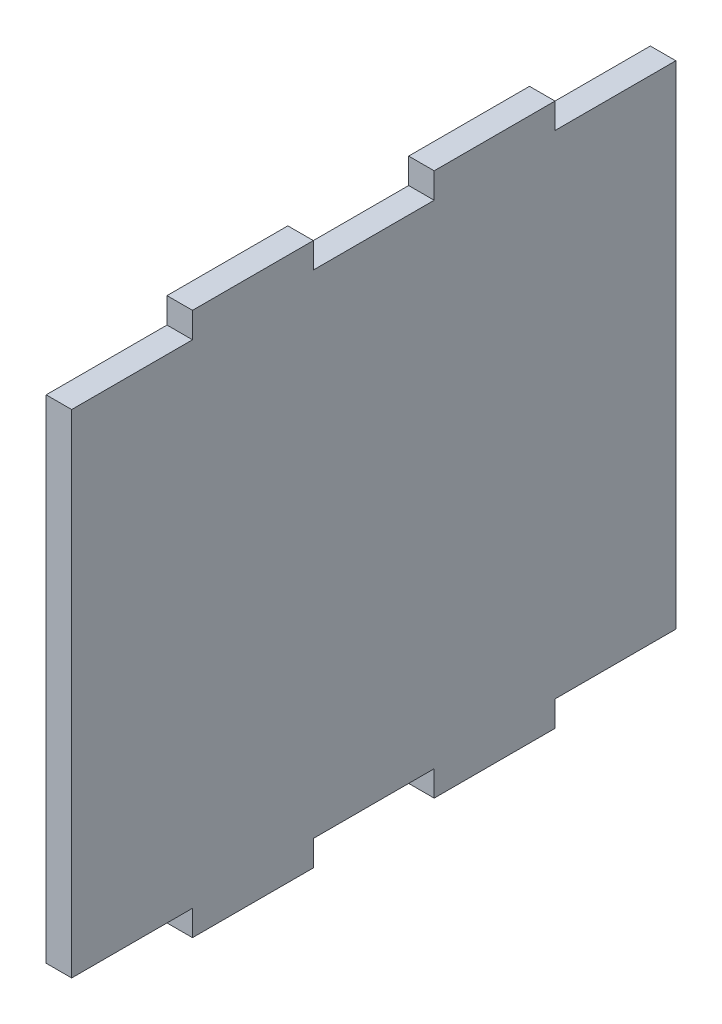
ISO-10303-21;
HEADER;
FILE_DESCRIPTION(('STEP AP214'),'2;1');
FILE_NAME('part.step','',(''),(''),'','','');
FILE_SCHEMA(('AUTOMOTIVE_DESIGN { 1 0 10303 214 1 1 1 1 }'));
ENDSEC;
DATA;
#1=APPLICATION_CONTEXT('core data for automotive mechanical design processes');
#2=APPLICATION_PROTOCOL_DEFINITION('international standard','automotive_design',2000,#1);
#3=PRODUCT_CONTEXT('',#1,'mechanical');
#4=PRODUCT('Part','Part','',(#3));
#5=PRODUCT_RELATED_PRODUCT_CATEGORY('part','',(#4));
#6=PRODUCT_DEFINITION_FORMATION('','',#4);
#7=PRODUCT_DEFINITION_CONTEXT('part definition',#1,'design');
#8=PRODUCT_DEFINITION('design','',#6,#7);
#9=PRODUCT_DEFINITION_SHAPE('','',#8);
#10=(LENGTH_UNIT() NAMED_UNIT(*) SI_UNIT(.MILLI.,.METRE.));
#11=(NAMED_UNIT(*) PLANE_ANGLE_UNIT() SI_UNIT($,.RADIAN.));
#12=(NAMED_UNIT(*) SI_UNIT($,.STERADIAN.) SOLID_ANGLE_UNIT());
#13=UNCERTAINTY_MEASURE_WITH_UNIT(LENGTH_MEASURE(1.E-05),#10,'distance_accuracy_value','');
#14=(GEOMETRIC_REPRESENTATION_CONTEXT(3) GLOBAL_UNCERTAINTY_ASSIGNED_CONTEXT((#13)) GLOBAL_UNIT_ASSIGNED_CONTEXT((#10,
#11,#12)) REPRESENTATION_CONTEXT('',''));
#15=CARTESIAN_POINT('',(0.,0.,0.));
#16=DIRECTION('',(0.,0.,1.));
#17=DIRECTION('',(1.,0.,0.));
#18=AXIS2_PLACEMENT_3D('',#15,#16,#17);
#19=CARTESIAN_POINT('',(5.7,0.,0.));
#20=DIRECTION('',(0.,0.,-1.));
#21=DIRECTION('',(-1.,0.,0.));
#22=AXIS2_PLACEMENT_3D('',#19,#20,#21);
#23=PLANE('',#22);
#24=DIRECTION('',(-1.,0.,0.));
#25=VECTOR('',#24,1.);
#26=CARTESIAN_POINT('',(57.,5.99999999999999,0.));
#27=LINE('',#26,#25);
#28=CARTESIAN_POINT('',(5.7,5.99999999999999,0.));
#29=VERTEX_POINT('',#28);
#30=CARTESIAN_POINT('',(0.,5.99999999999999,0.));
#31=VERTEX_POINT('',#30);
#32=EDGE_CURVE('E49',#29,#31,#27,.T.);
#33=ORIENTED_EDGE('',*,*,#32,.F.);
#34=DIRECTION('',(0.,-1.,0.));
#35=VECTOR('',#34,1.);
#36=CARTESIAN_POINT('',(5.7,0.,0.));
#37=LINE('',#36,#35);
#38=CARTESIAN_POINT('',(5.7,116.,0.));
#39=VERTEX_POINT('',#38);
#40=EDGE_CURVE('E41',#39,#29,#37,.T.);
#41=ORIENTED_EDGE('',*,*,#40,.F.);
#42=DIRECTION('',(-1.,0.,0.));
#43=VECTOR('',#42,1.);
#44=CARTESIAN_POINT('',(57.,116.,0.));
#45=LINE('',#44,#43);
#46=CARTESIAN_POINT('',(0.,116.,0.));
#47=VERTEX_POINT('',#46);
#48=EDGE_CURVE('E218',#39,#47,#45,.T.);
#49=ORIENTED_EDGE('',*,*,#48,.T.);
#50=DIRECTION('',(0.,-1.,0.));
#51=VECTOR('',#50,1.);
#52=CARTESIAN_POINT('',(0.,0.,0.));
#53=LINE('',#52,#51);
#54=EDGE_CURVE('E191',#47,#31,#53,.T.);
#55=ORIENTED_EDGE('',*,*,#54,.T.);
#56=EDGE_LOOP('',(#33,#41,#49,#55));
#57=FACE_BOUND('',#56,.T.);
#58=ADVANCED_FACE('F33',(#57),#23,.F.);
#59=CARTESIAN_POINT('',(5.7,0.,-135.));
#60=DIRECTION('',(0.,0.,1.));
#61=DIRECTION('',(1.,0.,0.));
#62=AXIS2_PLACEMENT_3D('',#59,#60,#61);
#63=PLANE('',#62);
#64=DIRECTION('',(-1.,0.,0.));
#65=VECTOR('',#64,1.);
#66=CARTESIAN_POINT('',(57.,5.99999999999999,-135.));
#67=LINE('',#66,#65);
#68=CARTESIAN_POINT('',(5.7,5.99999999999999,-135.));
#69=VERTEX_POINT('',#68);
#70=CARTESIAN_POINT('',(0.,5.99999999999999,-135.));
#71=VERTEX_POINT('',#70);
#72=EDGE_CURVE('E173',#69,#71,#67,.T.);
#73=ORIENTED_EDGE('',*,*,#72,.T.);
#74=DIRECTION('',(0.,1.,0.));
#75=VECTOR('',#74,1.);
#76=CARTESIAN_POINT('',(0.,0.,-135.));
#77=LINE('',#76,#75);
#78=CARTESIAN_POINT('',(0.,116.,-135.));
#79=VERTEX_POINT('',#78);
#80=EDGE_CURVE('E36',#71,#79,#77,.T.);
#81=ORIENTED_EDGE('',*,*,#80,.T.);
#82=DIRECTION('',(-1.,0.,0.));
#83=VECTOR('',#82,1.);
#84=CARTESIAN_POINT('',(57.,116.,-135.));
#85=LINE('',#84,#83);
#86=CARTESIAN_POINT('',(5.7,116.,-135.));
#87=VERTEX_POINT('',#86);
#88=EDGE_CURVE('E236',#87,#79,#85,.T.);
#89=ORIENTED_EDGE('',*,*,#88,.F.);
#90=DIRECTION('',(0.,1.,0.));
#91=VECTOR('',#90,1.);
#92=CARTESIAN_POINT('',(5.7,0.,-135.));
#93=LINE('',#92,#91);
#94=EDGE_CURVE('E11',#69,#87,#93,.T.);
#95=ORIENTED_EDGE('',*,*,#94,.F.);
#96=EDGE_LOOP('',(#73,#81,#89,#95));
#97=FACE_BOUND('',#96,.T.);
#98=ADVANCED_FACE('F183',(#97),#63,.F.);
#99=CARTESIAN_POINT('',(5.7,0.,0.));
#100=DIRECTION('',(-1.,0.,0.));
#101=DIRECTION('',(0.,0.,1.));
#102=AXIS2_PLACEMENT_3D('',#99,#100,#101);
#103=PLANE('',#102);
#104=DIRECTION('',(0.,0.,1.));
#105=VECTOR('',#104,1.);
#106=CARTESIAN_POINT('',(5.7,5.99999999999999,0.));
#107=LINE('',#106,#105);
#108=CARTESIAN_POINT('',(5.7,5.99999999999999,-108.));
#109=VERTEX_POINT('',#108);
#110=EDGE_CURVE('E262',#69,#109,#107,.T.);
#111=ORIENTED_EDGE('',*,*,#110,.F.);
#112=ORIENTED_EDGE('',*,*,#94,.T.);
#113=DIRECTION('',(0.,0.,-1.));
#114=VECTOR('',#113,1.);
#115=CARTESIAN_POINT('',(5.7,116.,0.));
#116=LINE('',#115,#114);
#117=CARTESIAN_POINT('',(5.7,116.,-108.));
#118=VERTEX_POINT('',#117);
#119=EDGE_CURVE('E215',#118,#87,#116,.T.);
#120=ORIENTED_EDGE('',*,*,#119,.F.);
#121=DIRECTION('',(0.,-1.,0.));
#122=VECTOR('',#121,1.);
#123=CARTESIAN_POINT('',(5.7,0.,-108.));
#124=LINE('',#123,#122);
#125=CARTESIAN_POINT('',(5.7,121.7,-108.));
#126=VERTEX_POINT('',#125);
#127=EDGE_CURVE('E213',#126,#118,#124,.T.);
#128=ORIENTED_EDGE('',*,*,#127,.F.);
#129=DIRECTION('',(0.,0.,-1.));
#130=VECTOR('',#129,1.);
#131=CARTESIAN_POINT('',(5.7,121.7,0.));
#132=LINE('',#131,#130);
#133=CARTESIAN_POINT('',(5.7,121.7,-81.));
#134=VERTEX_POINT('',#133);
#135=EDGE_CURVE('E211',#134,#126,#132,.T.);
#136=ORIENTED_EDGE('',*,*,#135,.F.);
#137=DIRECTION('',(0.,1.,0.));
#138=VECTOR('',#137,1.);
#139=CARTESIAN_POINT('',(5.7,0.,-81.));
#140=LINE('',#139,#138);
#141=CARTESIAN_POINT('',(5.7,116.,-81.));
#142=VERTEX_POINT('',#141);
#143=EDGE_CURVE('E209',#142,#134,#140,.T.);
#144=ORIENTED_EDGE('',*,*,#143,.F.);
#145=DIRECTION('',(0.,0.,-1.));
#146=VECTOR('',#145,1.);
#147=CARTESIAN_POINT('',(5.7,116.,0.));
#148=LINE('',#147,#146);
#149=CARTESIAN_POINT('',(5.7,116.,-54.));
#150=VERTEX_POINT('',#149);
#151=EDGE_CURVE('E207',#150,#142,#148,.T.);
#152=ORIENTED_EDGE('',*,*,#151,.F.);
#153=DIRECTION('',(0.,-1.,0.));
#154=VECTOR('',#153,1.);
#155=CARTESIAN_POINT('',(5.7,0.,-54.));
#156=LINE('',#155,#154);
#157=CARTESIAN_POINT('',(5.7,121.7,-54.));
#158=VERTEX_POINT('',#157);
#159=EDGE_CURVE('E205',#158,#150,#156,.T.);
#160=ORIENTED_EDGE('',*,*,#159,.F.);
#161=DIRECTION('',(0.,0.,-1.));
#162=VECTOR('',#161,1.);
#163=CARTESIAN_POINT('',(5.7,121.7,0.));
#164=LINE('',#163,#162);
#165=CARTESIAN_POINT('',(5.7,121.7,-27.));
#166=VERTEX_POINT('',#165);
#167=EDGE_CURVE('E203',#166,#158,#164,.T.);
#168=ORIENTED_EDGE('',*,*,#167,.F.);
#169=DIRECTION('',(0.,1.,0.));
#170=VECTOR('',#169,1.);
#171=CARTESIAN_POINT('',(5.7,0.,-27.));
#172=LINE('',#171,#170);
#173=CARTESIAN_POINT('',(5.7,116.,-27.));
#174=VERTEX_POINT('',#173);
#175=EDGE_CURVE('E199',#174,#166,#172,.T.);
#176=ORIENTED_EDGE('',*,*,#175,.F.);
#177=DIRECTION('',(0.,0.,-1.));
#178=VECTOR('',#177,1.);
#179=CARTESIAN_POINT('',(5.7,116.,0.));
#180=LINE('',#179,#178);
#181=EDGE_CURVE('E195',#39,#174,#180,.T.);
#182=ORIENTED_EDGE('',*,*,#181,.F.);
#183=ORIENTED_EDGE('',*,*,#40,.T.);
#184=DIRECTION('',(0.,0.,1.));
#185=VECTOR('',#184,1.);
#186=CARTESIAN_POINT('',(5.7,5.99999999999999,0.));
#187=LINE('',#186,#185);
#188=CARTESIAN_POINT('',(5.7,5.99999999999999,-27.));
#189=VERTEX_POINT('',#188);
#190=EDGE_CURVE('E184',#189,#29,#187,.T.);
#191=ORIENTED_EDGE('',*,*,#190,.F.);
#192=DIRECTION('',(0.,1.,0.));
#193=VECTOR('',#192,1.);
#194=CARTESIAN_POINT('',(5.7,0.,-27.));
#195=LINE('',#194,#193);
#196=CARTESIAN_POINT('',(5.7,0.299999999999991,-27.));
#197=VERTEX_POINT('',#196);
#198=EDGE_CURVE('E276',#197,#189,#195,.T.);
#199=ORIENTED_EDGE('',*,*,#198,.F.);
#200=DIRECTION('',(0.,0.,1.));
#201=VECTOR('',#200,1.);
#202=CARTESIAN_POINT('',(5.7,0.299999999999991,0.));
#203=LINE('',#202,#201);
#204=CARTESIAN_POINT('',(5.7,0.299999999999991,-54.));
#205=VERTEX_POINT('',#204);
#206=EDGE_CURVE('E274',#205,#197,#203,.T.);
#207=ORIENTED_EDGE('',*,*,#206,.F.);
#208=DIRECTION('',(0.,-1.,0.));
#209=VECTOR('',#208,1.);
#210=CARTESIAN_POINT('',(5.7,0.,-54.));
#211=LINE('',#210,#209);
#212=CARTESIAN_POINT('',(5.7,5.99999999999999,-54.));
#213=VERTEX_POINT('',#212);
#214=EDGE_CURVE('E272',#213,#205,#211,.T.);
#215=ORIENTED_EDGE('',*,*,#214,.F.);
#216=DIRECTION('',(0.,0.,1.));
#217=VECTOR('',#216,1.);
#218=CARTESIAN_POINT('',(5.7,5.99999999999999,0.));
#219=LINE('',#218,#217);
#220=CARTESIAN_POINT('',(5.7,5.99999999999999,-81.));
#221=VERTEX_POINT('',#220);
#222=EDGE_CURVE('E270',#221,#213,#219,.T.);
#223=ORIENTED_EDGE('',*,*,#222,.F.);
#224=DIRECTION('',(0.,1.,0.));
#225=VECTOR('',#224,1.);
#226=CARTESIAN_POINT('',(5.7,0.,-81.));
#227=LINE('',#226,#225);
#228=CARTESIAN_POINT('',(5.7,0.299999999999991,-81.));
#229=VERTEX_POINT('',#228);
#230=EDGE_CURVE('E268',#229,#221,#227,.T.);
#231=ORIENTED_EDGE('',*,*,#230,.F.);
#232=DIRECTION('',(0.,0.,1.));
#233=VECTOR('',#232,1.);
#234=CARTESIAN_POINT('',(5.7,0.299999999999991,0.));
#235=LINE('',#234,#233);
#236=CARTESIAN_POINT('',(5.7,0.299999999999991,-108.));
#237=VERTEX_POINT('',#236);
#238=EDGE_CURVE('E266',#237,#229,#235,.T.);
#239=ORIENTED_EDGE('',*,*,#238,.F.);
#240=DIRECTION('',(0.,-1.,0.));
#241=VECTOR('',#240,1.);
#242=CARTESIAN_POINT('',(5.7,0.,-108.));
#243=LINE('',#242,#241);
#244=EDGE_CURVE('E264',#109,#237,#243,.T.);
#245=ORIENTED_EDGE('',*,*,#244,.F.);
#246=EDGE_LOOP('',(#111,#112,#120,#128,#136,#144,#152,#160,#168,#176,#182,#183,#191,#199,#207,
#215,#223,#231,#239,#245));
#247=FACE_BOUND('',#246,.T.);
#248=ADVANCED_FACE('F361',(#247),#103,.F.);
#249=CARTESIAN_POINT('',(0.,0.,0.));
#250=DIRECTION('',(-1.,0.,0.));
#251=DIRECTION('',(0.,0.,1.));
#252=AXIS2_PLACEMENT_3D('',#249,#250,#251);
#253=PLANE('',#252);
#254=ORIENTED_EDGE('',*,*,#80,.F.);
#255=DIRECTION('',(0.,0.,1.));
#256=VECTOR('',#255,1.);
#257=CARTESIAN_POINT('',(0.,5.99999999999999,-108.));
#258=LINE('',#257,#256);
#259=CARTESIAN_POINT('',(0.,5.99999999999999,-108.));
#260=VERTEX_POINT('',#259);
#261=EDGE_CURVE('E171',#71,#260,#258,.T.);
#262=ORIENTED_EDGE('',*,*,#261,.T.);
#263=DIRECTION('',(0.,-1.,0.));
#264=VECTOR('',#263,1.);
#265=CARTESIAN_POINT('',(0.,0.299999999999991,-108.));
#266=LINE('',#265,#264);
#267=CARTESIAN_POINT('',(0.,0.299999999999991,-108.));
#268=VERTEX_POINT('',#267);
#269=EDGE_CURVE('E180',#260,#268,#266,.T.);
#270=ORIENTED_EDGE('',*,*,#269,.T.);
#271=DIRECTION('',(0.,0.,1.));
#272=VECTOR('',#271,1.);
#273=CARTESIAN_POINT('',(0.,0.299999999999991,-81.));
#274=LINE('',#273,#272);
#275=CARTESIAN_POINT('',(0.,0.299999999999991,-81.));
#276=VERTEX_POINT('',#275);
#277=EDGE_CURVE('E312',#268,#276,#274,.T.);
#278=ORIENTED_EDGE('',*,*,#277,.T.);
#279=DIRECTION('',(0.,1.,0.));
#280=VECTOR('',#279,1.);
#281=CARTESIAN_POINT('',(0.,5.99999999999999,-81.));
#282=LINE('',#281,#280);
#283=CARTESIAN_POINT('',(0.,5.99999999999999,-81.));
#284=VERTEX_POINT('',#283);
#285=EDGE_CURVE('E309',#276,#284,#282,.T.);
#286=ORIENTED_EDGE('',*,*,#285,.T.);
#287=DIRECTION('',(0.,0.,1.));
#288=VECTOR('',#287,1.);
#289=CARTESIAN_POINT('',(0.,5.99999999999999,-54.));
#290=LINE('',#289,#288);
#291=CARTESIAN_POINT('',(0.,5.99999999999999,-54.));
#292=VERTEX_POINT('',#291);
#293=EDGE_CURVE('E306',#284,#292,#290,.T.);
#294=ORIENTED_EDGE('',*,*,#293,.T.);
#295=DIRECTION('',(0.,-1.,0.));
#296=VECTOR('',#295,1.);
#297=CARTESIAN_POINT('',(0.,0.299999999999991,-54.));
#298=LINE('',#297,#296);
#299=CARTESIAN_POINT('',(0.,0.299999999999991,-54.));
#300=VERTEX_POINT('',#299);
#301=EDGE_CURVE('E303',#292,#300,#298,.T.);
#302=ORIENTED_EDGE('',*,*,#301,.T.);
#303=DIRECTION('',(0.,0.,1.));
#304=VECTOR('',#303,1.);
#305=CARTESIAN_POINT('',(0.,0.299999999999991,-27.));
#306=LINE('',#305,#304);
#307=CARTESIAN_POINT('',(0.,0.299999999999991,-27.));
#308=VERTEX_POINT('',#307);
#309=EDGE_CURVE('E300',#300,#308,#306,.T.);
#310=ORIENTED_EDGE('',*,*,#309,.T.);
#311=DIRECTION('',(0.,1.,0.));
#312=VECTOR('',#311,1.);
#313=CARTESIAN_POINT('',(0.,5.99999999999999,-27.));
#314=LINE('',#313,#312);
#315=CARTESIAN_POINT('',(0.,5.99999999999999,-27.));
#316=VERTEX_POINT('',#315);
#317=EDGE_CURVE('E297',#308,#316,#314,.T.);
#318=ORIENTED_EDGE('',*,*,#317,.T.);
#319=DIRECTION('',(0.,0.,1.));
#320=VECTOR('',#319,1.);
#321=CARTESIAN_POINT('',(0.,5.99999999999999,0.));
#322=LINE('',#321,#320);
#323=EDGE_CURVE('E295',#316,#31,#322,.T.);
#324=ORIENTED_EDGE('',*,*,#323,.T.);
#325=ORIENTED_EDGE('',*,*,#54,.F.);
#326=DIRECTION('',(0.,0.,-1.));
#327=VECTOR('',#326,1.);
#328=CARTESIAN_POINT('',(0.,116.,0.));
#329=LINE('',#328,#327);
#330=CARTESIAN_POINT('',(0.,116.,-27.));
#331=VERTEX_POINT('',#330);
#332=EDGE_CURVE('E259',#47,#331,#329,.T.);
#333=ORIENTED_EDGE('',*,*,#332,.T.);
#334=DIRECTION('',(0.,1.,0.));
#335=VECTOR('',#334,1.);
#336=CARTESIAN_POINT('',(0.,116.,-27.));
#337=LINE('',#336,#335);
#338=CARTESIAN_POINT('',(0.,121.7,-27.));
#339=VERTEX_POINT('',#338);
#340=EDGE_CURVE('E256',#331,#339,#337,.T.);
#341=ORIENTED_EDGE('',*,*,#340,.T.);
#342=DIRECTION('',(0.,0.,-1.));
#343=VECTOR('',#342,1.);
#344=CARTESIAN_POINT('',(0.,121.7,-27.));
#345=LINE('',#344,#343);
#346=CARTESIAN_POINT('',(0.,121.7,-54.));
#347=VERTEX_POINT('',#346);
#348=EDGE_CURVE('E253',#339,#347,#345,.T.);
#349=ORIENTED_EDGE('',*,*,#348,.T.);
#350=DIRECTION('',(0.,-1.,0.));
#351=VECTOR('',#350,1.);
#352=CARTESIAN_POINT('',(0.,121.7,-54.));
#353=LINE('',#352,#351);
#354=CARTESIAN_POINT('',(0.,116.,-54.));
#355=VERTEX_POINT('',#354);
#356=EDGE_CURVE('E250',#347,#355,#353,.T.);
#357=ORIENTED_EDGE('',*,*,#356,.T.);
#358=DIRECTION('',(0.,0.,-1.));
#359=VECTOR('',#358,1.);
#360=CARTESIAN_POINT('',(0.,116.,-54.));
#361=LINE('',#360,#359);
#362=CARTESIAN_POINT('',(0.,116.,-81.));
#363=VERTEX_POINT('',#362);
#364=EDGE_CURVE('E247',#355,#363,#361,.T.);
#365=ORIENTED_EDGE('',*,*,#364,.T.);
#366=DIRECTION('',(0.,1.,0.));
#367=VECTOR('',#366,1.);
#368=CARTESIAN_POINT('',(0.,116.,-81.));
#369=LINE('',#368,#367);
#370=CARTESIAN_POINT('',(0.,121.7,-81.));
#371=VERTEX_POINT('',#370);
#372=EDGE_CURVE('E244',#363,#371,#369,.T.);
#373=ORIENTED_EDGE('',*,*,#372,.T.);
#374=DIRECTION('',(0.,0.,-1.));
#375=VECTOR('',#374,1.);
#376=CARTESIAN_POINT('',(0.,121.7,-81.));
#377=LINE('',#376,#375);
#378=CARTESIAN_POINT('',(0.,121.7,-108.));
#379=VERTEX_POINT('',#378);
#380=EDGE_CURVE('E241',#371,#379,#377,.T.);
#381=ORIENTED_EDGE('',*,*,#380,.T.);
#382=DIRECTION('',(0.,-1.,0.));
#383=VECTOR('',#382,1.);
#384=CARTESIAN_POINT('',(0.,121.7,-108.));
#385=LINE('',#384,#383);
#386=CARTESIAN_POINT('',(0.,116.,-108.));
#387=VERTEX_POINT('',#386);
#388=EDGE_CURVE('E239',#379,#387,#385,.T.);
#389=ORIENTED_EDGE('',*,*,#388,.T.);
#390=DIRECTION('',(0.,0.,-1.));
#391=VECTOR('',#390,1.);
#392=CARTESIAN_POINT('',(0.,116.,-108.));
#393=LINE('',#392,#391);
#394=EDGE_CURVE('E190',#387,#79,#393,.T.);
#395=ORIENTED_EDGE('',*,*,#394,.T.);
#396=EDGE_LOOP('',(#254,#262,#270,#278,#286,#294,#302,#310,#318,#324,#325,#333,#341,#349,#357,
#365,#373,#381,#389,#395));
#397=FACE_BOUND('',#396,.T.);
#398=ADVANCED_FACE('F187',(#397),#253,.T.);
#399=CARTESIAN_POINT('',(57.,116.,0.));
#400=DIRECTION('',(0.,1.,0.));
#401=DIRECTION('',(0.,0.,1.));
#402=AXIS2_PLACEMENT_3D('',#399,#400,#401);
#403=PLANE('',#402);
#404=ORIENTED_EDGE('',*,*,#181,.T.);
#405=DIRECTION('',(-1.,0.,0.));
#406=VECTOR('',#405,1.);
#407=CARTESIAN_POINT('',(57.,116.,-27.));
#408=LINE('',#407,#406);
#409=EDGE_CURVE('E220',#174,#331,#408,.T.);
#410=ORIENTED_EDGE('',*,*,#409,.T.);
#411=ORIENTED_EDGE('',*,*,#332,.F.);
#412=ORIENTED_EDGE('',*,*,#48,.F.);
#413=EDGE_LOOP('',(#404,#410,#411,#412));
#414=FACE_BOUND('',#413,.T.);
#415=ADVANCED_FACE('F369',(#414),#403,.T.);
#416=CARTESIAN_POINT('',(57.,116.,-27.));
#417=DIRECTION('',(0.,0.,1.));
#418=DIRECTION('',(1.,0.,0.));
#419=AXIS2_PLACEMENT_3D('',#416,#417,#418);
#420=PLANE('',#419);
#421=ORIENTED_EDGE('',*,*,#175,.T.);
#422=DIRECTION('',(-1.,0.,0.));
#423=VECTOR('',#422,1.);
#424=CARTESIAN_POINT('',(57.,121.7,-27.));
#425=LINE('',#424,#423);
#426=EDGE_CURVE('E222',#166,#339,#425,.T.);
#427=ORIENTED_EDGE('',*,*,#426,.T.);
#428=ORIENTED_EDGE('',*,*,#340,.F.);
#429=ORIENTED_EDGE('',*,*,#409,.F.);
#430=EDGE_LOOP('',(#421,#427,#428,#429));
#431=FACE_BOUND('',#430,.T.);
#432=ADVANCED_FACE('F372',(#431),#420,.T.);
#433=CARTESIAN_POINT('',(57.,121.7,-27.));
#434=DIRECTION('',(0.,1.,0.));
#435=DIRECTION('',(0.,0.,1.));
#436=AXIS2_PLACEMENT_3D('',#433,#434,#435);
#437=PLANE('',#436);
#438=ORIENTED_EDGE('',*,*,#167,.T.);
#439=DIRECTION('',(-1.,0.,0.));
#440=VECTOR('',#439,1.);
#441=CARTESIAN_POINT('',(57.,121.7,-54.));
#442=LINE('',#441,#440);
#443=EDGE_CURVE('E224',#158,#347,#442,.T.);
#444=ORIENTED_EDGE('',*,*,#443,.T.);
#445=ORIENTED_EDGE('',*,*,#348,.F.);
#446=ORIENTED_EDGE('',*,*,#426,.F.);
#447=EDGE_LOOP('',(#438,#444,#445,#446));
#448=FACE_BOUND('',#447,.T.);
#449=ADVANCED_FACE('F377',(#448),#437,.T.);
#450=CARTESIAN_POINT('',(57.,121.7,-54.));
#451=DIRECTION('',(0.,0.,-1.));
#452=DIRECTION('',(-1.,0.,0.));
#453=AXIS2_PLACEMENT_3D('',#450,#451,#452);
#454=PLANE('',#453);
#455=ORIENTED_EDGE('',*,*,#159,.T.);
#456=DIRECTION('',(-1.,0.,0.));
#457=VECTOR('',#456,1.);
#458=CARTESIAN_POINT('',(57.,116.,-54.));
#459=LINE('',#458,#457);
#460=EDGE_CURVE('E226',#150,#355,#459,.T.);
#461=ORIENTED_EDGE('',*,*,#460,.T.);
#462=ORIENTED_EDGE('',*,*,#356,.F.);
#463=ORIENTED_EDGE('',*,*,#443,.F.);
#464=EDGE_LOOP('',(#455,#461,#462,#463));
#465=FACE_BOUND('',#464,.T.);
#466=ADVANCED_FACE('F381',(#465),#454,.T.);
#467=CARTESIAN_POINT('',(57.,116.,-54.));
#468=DIRECTION('',(0.,1.,0.));
#469=DIRECTION('',(0.,0.,1.));
#470=AXIS2_PLACEMENT_3D('',#467,#468,#469);
#471=PLANE('',#470);
#472=ORIENTED_EDGE('',*,*,#151,.T.);
#473=DIRECTION('',(-1.,0.,0.));
#474=VECTOR('',#473,1.);
#475=CARTESIAN_POINT('',(57.,116.,-81.));
#476=LINE('',#475,#474);
#477=EDGE_CURVE('E228',#142,#363,#476,.T.);
#478=ORIENTED_EDGE('',*,*,#477,.T.);
#479=ORIENTED_EDGE('',*,*,#364,.F.);
#480=ORIENTED_EDGE('',*,*,#460,.F.);
#481=EDGE_LOOP('',(#472,#478,#479,#480));
#482=FACE_BOUND('',#481,.T.);
#483=ADVANCED_FACE('F386',(#482),#471,.T.);
#484=CARTESIAN_POINT('',(57.,116.,-81.));
#485=DIRECTION('',(0.,0.,1.));
#486=DIRECTION('',(1.,0.,0.));
#487=AXIS2_PLACEMENT_3D('',#484,#485,#486);
#488=PLANE('',#487);
#489=ORIENTED_EDGE('',*,*,#143,.T.);
#490=DIRECTION('',(-1.,0.,0.));
#491=VECTOR('',#490,1.);
#492=CARTESIAN_POINT('',(57.,121.7,-81.));
#493=LINE('',#492,#491);
#494=EDGE_CURVE('E230',#134,#371,#493,.T.);
#495=ORIENTED_EDGE('',*,*,#494,.T.);
#496=ORIENTED_EDGE('',*,*,#372,.F.);
#497=ORIENTED_EDGE('',*,*,#477,.F.);
#498=EDGE_LOOP('',(#489,#495,#496,#497));
#499=FACE_BOUND('',#498,.T.);
#500=ADVANCED_FACE('F391',(#499),#488,.T.);
#501=CARTESIAN_POINT('',(57.,121.7,-81.));
#502=DIRECTION('',(0.,1.,0.));
#503=DIRECTION('',(0.,0.,1.));
#504=AXIS2_PLACEMENT_3D('',#501,#502,#503);
#505=PLANE('',#504);
#506=ORIENTED_EDGE('',*,*,#135,.T.);
#507=DIRECTION('',(-1.,0.,0.));
#508=VECTOR('',#507,1.);
#509=CARTESIAN_POINT('',(57.,121.7,-108.));
#510=LINE('',#509,#508);
#511=EDGE_CURVE('E232',#126,#379,#510,.T.);
#512=ORIENTED_EDGE('',*,*,#511,.T.);
#513=ORIENTED_EDGE('',*,*,#380,.F.);
#514=ORIENTED_EDGE('',*,*,#494,.F.);
#515=EDGE_LOOP('',(#506,#512,#513,#514));
#516=FACE_BOUND('',#515,.T.);
#517=ADVANCED_FACE('F396',(#516),#505,.T.);
#518=CARTESIAN_POINT('',(57.,121.7,-108.));
#519=DIRECTION('',(0.,0.,-1.));
#520=DIRECTION('',(-1.,0.,0.));
#521=AXIS2_PLACEMENT_3D('',#518,#519,#520);
#522=PLANE('',#521);
#523=ORIENTED_EDGE('',*,*,#127,.T.);
#524=DIRECTION('',(-1.,0.,0.));
#525=VECTOR('',#524,1.);
#526=CARTESIAN_POINT('',(57.,116.,-108.));
#527=LINE('',#526,#525);
#528=EDGE_CURVE('E234',#118,#387,#527,.T.);
#529=ORIENTED_EDGE('',*,*,#528,.T.);
#530=ORIENTED_EDGE('',*,*,#388,.F.);
#531=ORIENTED_EDGE('',*,*,#511,.F.);
#532=EDGE_LOOP('',(#523,#529,#530,#531));
#533=FACE_BOUND('',#532,.T.);
#534=ADVANCED_FACE('F401',(#533),#522,.T.);
#535=CARTESIAN_POINT('',(57.,116.,-108.));
#536=DIRECTION('',(0.,1.,0.));
#537=DIRECTION('',(0.,0.,1.));
#538=AXIS2_PLACEMENT_3D('',#535,#536,#537);
#539=PLANE('',#538);
#540=ORIENTED_EDGE('',*,*,#119,.T.);
#541=ORIENTED_EDGE('',*,*,#88,.T.);
#542=ORIENTED_EDGE('',*,*,#394,.F.);
#543=ORIENTED_EDGE('',*,*,#528,.F.);
#544=EDGE_LOOP('',(#540,#541,#542,#543));
#545=FACE_BOUND('',#544,.T.);
#546=ADVANCED_FACE('F405',(#545),#539,.T.);
#547=CARTESIAN_POINT('',(57.,5.99999999999999,-108.));
#548=DIRECTION('',(0.,-1.,0.));
#549=DIRECTION('',(0.,0.,-1.));
#550=AXIS2_PLACEMENT_3D('',#547,#548,#549);
#551=PLANE('',#550);
#552=ORIENTED_EDGE('',*,*,#110,.T.);
#553=DIRECTION('',(-1.,0.,0.));
#554=VECTOR('',#553,1.);
#555=CARTESIAN_POINT('',(57.,5.99999999999999,-108.));
#556=LINE('',#555,#554);
#557=EDGE_CURVE('E176',#109,#260,#556,.T.);
#558=ORIENTED_EDGE('',*,*,#557,.T.);
#559=ORIENTED_EDGE('',*,*,#261,.F.);
#560=ORIENTED_EDGE('',*,*,#72,.F.);
#561=EDGE_LOOP('',(#552,#558,#559,#560));
#562=FACE_BOUND('',#561,.T.);
#563=ADVANCED_FACE('F172',(#562),#551,.T.);
#564=CARTESIAN_POINT('',(57.,0.299999999999991,-108.));
#565=DIRECTION('',(0.,0.,-1.));
#566=DIRECTION('',(-1.,0.,0.));
#567=AXIS2_PLACEMENT_3D('',#564,#565,#566);
#568=PLANE('',#567);
#569=ORIENTED_EDGE('',*,*,#244,.T.);
#570=DIRECTION('',(-1.,0.,0.));
#571=VECTOR('',#570,1.);
#572=CARTESIAN_POINT('',(57.,0.299999999999991,-108.));
#573=LINE('',#572,#571);
#574=EDGE_CURVE('E280',#237,#268,#573,.T.);
#575=ORIENTED_EDGE('',*,*,#574,.T.);
#576=ORIENTED_EDGE('',*,*,#269,.F.);
#577=ORIENTED_EDGE('',*,*,#557,.F.);
#578=EDGE_LOOP('',(#569,#575,#576,#577));
#579=FACE_BOUND('',#578,.T.);
#580=ADVANCED_FACE('F317',(#579),#568,.T.);
#581=CARTESIAN_POINT('',(57.,0.299999999999991,-81.));
#582=DIRECTION('',(0.,-1.,0.));
#583=DIRECTION('',(0.,0.,-1.));
#584=AXIS2_PLACEMENT_3D('',#581,#582,#583);
#585=PLANE('',#584);
#586=ORIENTED_EDGE('',*,*,#238,.T.);
#587=DIRECTION('',(-1.,0.,0.));
#588=VECTOR('',#587,1.);
#589=CARTESIAN_POINT('',(57.,0.299999999999991,-81.));
#590=LINE('',#589,#588);
#591=EDGE_CURVE('E282',#229,#276,#590,.T.);
#592=ORIENTED_EDGE('',*,*,#591,.T.);
#593=ORIENTED_EDGE('',*,*,#277,.F.);
#594=ORIENTED_EDGE('',*,*,#574,.F.);
#595=EDGE_LOOP('',(#586,#592,#593,#594));
#596=FACE_BOUND('',#595,.T.);
#597=ADVANCED_FACE('F322',(#596),#585,.T.);
#598=CARTESIAN_POINT('',(57.,5.99999999999999,-81.));
#599=DIRECTION('',(0.,0.,1.));
#600=DIRECTION('',(1.,0.,0.));
#601=AXIS2_PLACEMENT_3D('',#598,#599,#600);
#602=PLANE('',#601);
#603=ORIENTED_EDGE('',*,*,#230,.T.);
#604=DIRECTION('',(-1.,0.,0.));
#605=VECTOR('',#604,1.);
#606=CARTESIAN_POINT('',(57.,5.99999999999999,-81.));
#607=LINE('',#606,#605);
#608=EDGE_CURVE('E284',#221,#284,#607,.T.);
#609=ORIENTED_EDGE('',*,*,#608,.T.);
#610=ORIENTED_EDGE('',*,*,#285,.F.);
#611=ORIENTED_EDGE('',*,*,#591,.F.);
#612=EDGE_LOOP('',(#603,#609,#610,#611));
#613=FACE_BOUND('',#612,.T.);
#614=ADVANCED_FACE('F327',(#613),#602,.T.);
#615=CARTESIAN_POINT('',(57.,5.99999999999999,-54.));
#616=DIRECTION('',(0.,-1.,0.));
#617=DIRECTION('',(0.,0.,-1.));
#618=AXIS2_PLACEMENT_3D('',#615,#616,#617);
#619=PLANE('',#618);
#620=ORIENTED_EDGE('',*,*,#222,.T.);
#621=DIRECTION('',(-1.,0.,0.));
#622=VECTOR('',#621,1.);
#623=CARTESIAN_POINT('',(57.,5.99999999999999,-54.));
#624=LINE('',#623,#622);
#625=EDGE_CURVE('E286',#213,#292,#624,.T.);
#626=ORIENTED_EDGE('',*,*,#625,.T.);
#627=ORIENTED_EDGE('',*,*,#293,.F.);
#628=ORIENTED_EDGE('',*,*,#608,.F.);
#629=EDGE_LOOP('',(#620,#626,#627,#628));
#630=FACE_BOUND('',#629,.T.);
#631=ADVANCED_FACE('F332',(#630),#619,.T.);
#632=CARTESIAN_POINT('',(57.,0.299999999999991,-54.));
#633=DIRECTION('',(0.,0.,-1.));
#634=DIRECTION('',(-1.,0.,0.));
#635=AXIS2_PLACEMENT_3D('',#632,#633,#634);
#636=PLANE('',#635);
#637=ORIENTED_EDGE('',*,*,#214,.T.);
#638=DIRECTION('',(-1.,0.,0.));
#639=VECTOR('',#638,1.);
#640=CARTESIAN_POINT('',(57.,0.299999999999991,-54.));
#641=LINE('',#640,#639);
#642=EDGE_CURVE('E288',#205,#300,#641,.T.);
#643=ORIENTED_EDGE('',*,*,#642,.T.);
#644=ORIENTED_EDGE('',*,*,#301,.F.);
#645=ORIENTED_EDGE('',*,*,#625,.F.);
#646=EDGE_LOOP('',(#637,#643,#644,#645));
#647=FACE_BOUND('',#646,.T.);
#648=ADVANCED_FACE('F337',(#647),#636,.T.);
#649=CARTESIAN_POINT('',(57.,0.299999999999991,-27.));
#650=DIRECTION('',(0.,-1.,0.));
#651=DIRECTION('',(0.,0.,-1.));
#652=AXIS2_PLACEMENT_3D('',#649,#650,#651);
#653=PLANE('',#652);
#654=ORIENTED_EDGE('',*,*,#206,.T.);
#655=DIRECTION('',(-1.,0.,0.));
#656=VECTOR('',#655,1.);
#657=CARTESIAN_POINT('',(57.,0.299999999999991,-27.));
#658=LINE('',#657,#656);
#659=EDGE_CURVE('E290',#197,#308,#658,.T.);
#660=ORIENTED_EDGE('',*,*,#659,.T.);
#661=ORIENTED_EDGE('',*,*,#309,.F.);
#662=ORIENTED_EDGE('',*,*,#642,.F.);
#663=EDGE_LOOP('',(#654,#660,#661,#662));
#664=FACE_BOUND('',#663,.T.);
#665=ADVANCED_FACE('F342',(#664),#653,.T.);
#666=CARTESIAN_POINT('',(57.,5.99999999999999,-27.));
#667=DIRECTION('',(0.,0.,1.));
#668=DIRECTION('',(1.,0.,0.));
#669=AXIS2_PLACEMENT_3D('',#666,#667,#668);
#670=PLANE('',#669);
#671=ORIENTED_EDGE('',*,*,#198,.T.);
#672=DIRECTION('',(-1.,0.,0.));
#673=VECTOR('',#672,1.);
#674=CARTESIAN_POINT('',(57.,5.99999999999999,-27.));
#675=LINE('',#674,#673);
#676=EDGE_CURVE('E292',#189,#316,#675,.T.);
#677=ORIENTED_EDGE('',*,*,#676,.T.);
#678=ORIENTED_EDGE('',*,*,#317,.F.);
#679=ORIENTED_EDGE('',*,*,#659,.F.);
#680=EDGE_LOOP('',(#671,#677,#678,#679));
#681=FACE_BOUND('',#680,.T.);
#682=ADVANCED_FACE('F346',(#681),#670,.T.);
#683=CARTESIAN_POINT('',(57.,5.99999999999999,0.));
#684=DIRECTION('',(0.,-1.,0.));
#685=DIRECTION('',(0.,0.,-1.));
#686=AXIS2_PLACEMENT_3D('',#683,#684,#685);
#687=PLANE('',#686);
#688=ORIENTED_EDGE('',*,*,#190,.T.);
#689=ORIENTED_EDGE('',*,*,#32,.T.);
#690=ORIENTED_EDGE('',*,*,#323,.F.);
#691=ORIENTED_EDGE('',*,*,#676,.F.);
#692=EDGE_LOOP('',(#688,#689,#690,#691));
#693=FACE_BOUND('',#692,.T.);
#694=ADVANCED_FACE('F350',(#693),#687,.T.);
#695=CLOSED_SHELL('',(#58,#98,#248,#398,#415,#432,#449,#466,#483,#500,#517,#534,#546,#563,#580,
#597,#614,#631,#648,#665,#682,#694));
#696=MANIFOLD_SOLID_BREP('B2',#695);
#697=ADVANCED_BREP_SHAPE_REPRESENTATION('',(#18,#696),#14);
#698=SHAPE_DEFINITION_REPRESENTATION(#9,#697);
ENDSEC;
END-ISO-10303-21;
